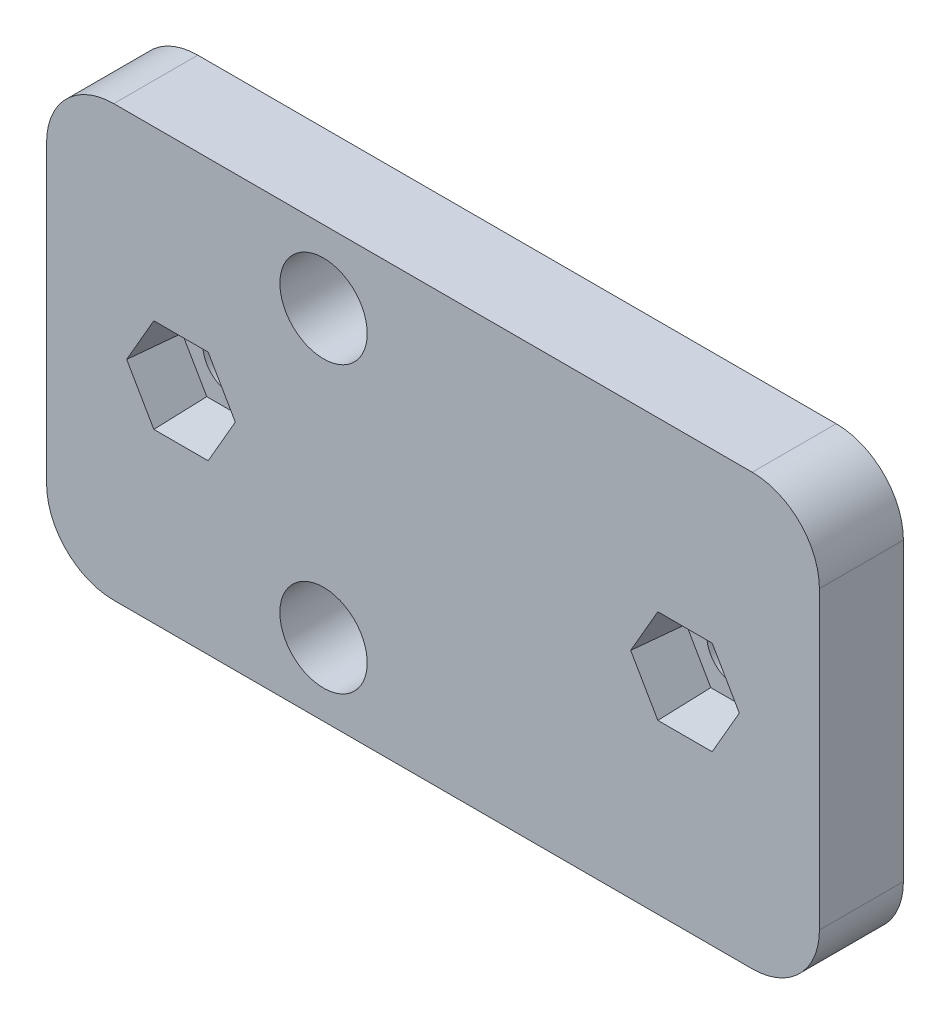
ISO-10303-21;
HEADER;
FILE_DESCRIPTION(('STEP AP214'),'2;1');
FILE_NAME('part.step','',(''),(''),'','','');
FILE_SCHEMA(('AUTOMOTIVE_DESIGN { 1 0 10303 214 1 1 1 1 }'));
ENDSEC;
DATA;
#1=APPLICATION_CONTEXT('core data for automotive mechanical design processes');
#2=APPLICATION_PROTOCOL_DEFINITION('international standard','automotive_design',2000,#1);
#3=PRODUCT_CONTEXT('',#1,'mechanical');
#4=PRODUCT('Part','Part','',(#3));
#5=PRODUCT_RELATED_PRODUCT_CATEGORY('part','',(#4));
#6=PRODUCT_DEFINITION_FORMATION('','',#4);
#7=PRODUCT_DEFINITION_CONTEXT('part definition',#1,'design');
#8=PRODUCT_DEFINITION('design','',#6,#7);
#9=PRODUCT_DEFINITION_SHAPE('','',#8);
#10=(LENGTH_UNIT() NAMED_UNIT(*) SI_UNIT(.MILLI.,.METRE.));
#11=(NAMED_UNIT(*) PLANE_ANGLE_UNIT() SI_UNIT($,.RADIAN.));
#12=(NAMED_UNIT(*) SI_UNIT($,.STERADIAN.) SOLID_ANGLE_UNIT());
#13=UNCERTAINTY_MEASURE_WITH_UNIT(LENGTH_MEASURE(1.E-05),#10,'distance_accuracy_value','');
#14=(GEOMETRIC_REPRESENTATION_CONTEXT(3) GLOBAL_UNCERTAINTY_ASSIGNED_CONTEXT((#13)) GLOBAL_UNIT_ASSIGNED_CONTEXT((#10,
#11,#12)) REPRESENTATION_CONTEXT('',''));
#15=CARTESIAN_POINT('',(0.,0.,0.));
#16=DIRECTION('',(0.,0.,1.));
#17=DIRECTION('',(1.,0.,0.));
#18=AXIS2_PLACEMENT_3D('',#15,#16,#17);
#19=CARTESIAN_POINT('',(30.8300474764991,0.,5.));
#20=DIRECTION('',(0.,0.,-1.));
#21=DIRECTION('',(-1.,0.,0.));
#22=AXIS2_PLACEMENT_3D('',#19,#20,#21);
#23=CYLINDRICAL_SURFACE('',#22,1.7);
#24=CARTESIAN_POINT('',(30.8300474764991,0.,0.));
#25=DIRECTION('',(0.,0.,1.));
#26=DIRECTION('',(-1.,0.,0.));
#27=AXIS2_PLACEMENT_3D('',#24,#25,#26);
#28=CIRCLE('',#27,1.7);
#29=CARTESIAN_POINT('',(29.1300474764991,0.,0.));
#30=VERTEX_POINT('',#29);
#31=EDGE_CURVE('E316',#30,#30,#28,.T.);
#32=ORIENTED_EDGE('',*,*,#31,.F.);
#33=EDGE_LOOP('',(#32));
#34=FACE_BOUND('',#33,.T.);
#35=CARTESIAN_POINT('',(30.8300474764991,0.,2.));
#36=DIRECTION('',(0.,0.,1.));
#37=DIRECTION('',(1.,0.,0.));
#38=AXIS2_PLACEMENT_3D('',#35,#36,#37);
#39=CIRCLE('',#38,1.7);
#40=CARTESIAN_POINT('',(32.5300474764991,0.,2.));
#41=VERTEX_POINT('',#40);
#42=EDGE_CURVE('E237',#41,#41,#39,.T.);
#43=ORIENTED_EDGE('',*,*,#42,.T.);
#44=EDGE_LOOP('',(#43));
#45=FACE_BOUND('',#44,.T.);
#46=ADVANCED_FACE('F39',(#34,#45),#23,.F.);
#47=CARTESIAN_POINT('',(0.83004747649909,0.,5.));
#48=DIRECTION('',(0.,0.,-1.));
#49=DIRECTION('',(-1.,0.,0.));
#50=AXIS2_PLACEMENT_3D('',#47,#48,#49);
#51=CYLINDRICAL_SURFACE('',#50,1.7);
#52=CARTESIAN_POINT('',(0.83004747649909,0.,0.));
#53=DIRECTION('',(0.,0.,1.));
#54=DIRECTION('',(1.,0.,0.));
#55=AXIS2_PLACEMENT_3D('',#52,#53,#54);
#56=CIRCLE('',#55,1.7);
#57=CARTESIAN_POINT('',(2.53004747649909,0.,0.));
#58=VERTEX_POINT('',#57);
#59=EDGE_CURVE('E330',#58,#58,#56,.T.);
#60=ORIENTED_EDGE('',*,*,#59,.F.);
#61=EDGE_LOOP('',(#60));
#62=FACE_BOUND('',#61,.T.);
#63=CARTESIAN_POINT('',(0.83004747649909,0.,2.));
#64=DIRECTION('',(0.,0.,1.));
#65=DIRECTION('',(1.,0.,0.));
#66=AXIS2_PLACEMENT_3D('',#63,#64,#65);
#67=CIRCLE('',#66,1.7);
#68=CARTESIAN_POINT('',(2.53004747649909,0.,2.));
#69=VERTEX_POINT('',#68);
#70=EDGE_CURVE('E287',#69,#69,#67,.T.);
#71=ORIENTED_EDGE('',*,*,#70,.T.);
#72=EDGE_LOOP('',(#71));
#73=FACE_BOUND('',#72,.T.);
#74=ADVANCED_FACE('F433',(#62,#73),#51,.F.);
#75=CARTESIAN_POINT('',(0.,0.,5.));
#76=DIRECTION('',(0.,0.,-1.));
#77=DIRECTION('',(-1.,0.,0.));
#78=AXIS2_PLACEMENT_3D('',#75,#76,#77);
#79=PLANE('',#78);
#80=DIRECTION('',(-0.5,0.866025403784439,0.));
#81=VECTOR('',#80,1.);
#82=CARTESIAN_POINT('',(34.063208983961,0.,5.));
#83=LINE('',#82,#81);
#84=CARTESIAN_POINT('',(34.063208983961,0.,5.));
#85=VERTEX_POINT('',#84);
#86=CARTESIAN_POINT('',(32.44662823023,2.8,5.));
#87=VERTEX_POINT('',#86);
#88=EDGE_CURVE('E206',#85,#87,#83,.T.);
#89=ORIENTED_EDGE('',*,*,#88,.F.);
#90=DIRECTION('',(0.5,0.866025403784439,0.));
#91=VECTOR('',#90,1.);
#92=CARTESIAN_POINT('',(32.44662823023,-2.79999999999999,5.));
#93=LINE('',#92,#91);
#94=CARTESIAN_POINT('',(32.44662823023,-2.79999999999999,5.));
#95=VERTEX_POINT('',#94);
#96=EDGE_CURVE('E211',#95,#85,#93,.T.);
#97=ORIENTED_EDGE('',*,*,#96,.F.);
#98=DIRECTION('',(1.,0.,0.));
#99=VECTOR('',#98,1.);
#100=CARTESIAN_POINT('',(29.2134667227681,-2.79999999999999,5.));
#101=LINE('',#100,#99);
#102=CARTESIAN_POINT('',(29.2134667227681,-2.79999999999999,5.));
#103=VERTEX_POINT('',#102);
#104=EDGE_CURVE('E229',#103,#95,#101,.T.);
#105=ORIENTED_EDGE('',*,*,#104,.F.);
#106=DIRECTION('',(0.499999999999999,-0.866025403784439,0.));
#107=VECTOR('',#106,1.);
#108=CARTESIAN_POINT('',(27.5968859690372,0.,5.));
#109=LINE('',#108,#107);
#110=CARTESIAN_POINT('',(27.5968859690372,0.,5.));
#111=VERTEX_POINT('',#110);
#112=EDGE_CURVE('E222',#111,#103,#109,.T.);
#113=ORIENTED_EDGE('',*,*,#112,.F.);
#114=DIRECTION('',(-0.5,-0.866025403784439,0.));
#115=VECTOR('',#114,1.);
#116=CARTESIAN_POINT('',(29.2134667227681,2.8,5.));
#117=LINE('',#116,#115);
#118=CARTESIAN_POINT('',(29.2134667227681,2.8,5.));
#119=VERTEX_POINT('',#118);
#120=EDGE_CURVE('E217',#119,#111,#117,.T.);
#121=ORIENTED_EDGE('',*,*,#120,.F.);
#122=DIRECTION('',(-1.,0.,0.));
#123=VECTOR('',#122,1.);
#124=CARTESIAN_POINT('',(32.44662823023,2.8,5.));
#125=LINE('',#124,#123);
#126=EDGE_CURVE('E193',#87,#119,#125,.T.);
#127=ORIENTED_EDGE('',*,*,#126,.F.);
#128=EDGE_LOOP('',(#89,#97,#105,#113,#121,#127));
#129=FACE_BOUND('',#128,.T.);
#130=DIRECTION('',(-0.5,0.866025403784439,0.));
#131=VECTOR('',#130,1.);
#132=CARTESIAN_POINT('',(4.063208983961,0.,5.));
#133=LINE('',#132,#131);
#134=CARTESIAN_POINT('',(4.063208983961,0.,5.));
#135=VERTEX_POINT('',#134);
#136=CARTESIAN_POINT('',(2.44662823023005,2.80000000000001,5.));
#137=VERTEX_POINT('',#136);
#138=EDGE_CURVE('E269',#135,#137,#133,.T.);
#139=ORIENTED_EDGE('',*,*,#138,.F.);
#140=DIRECTION('',(0.5,0.866025403784439,0.));
#141=VECTOR('',#140,1.);
#142=CARTESIAN_POINT('',(2.44662823023004,-2.80000000000001,5.));
#143=LINE('',#142,#141);
#144=CARTESIAN_POINT('',(2.44662823023004,-2.80000000000001,5.));
#145=VERTEX_POINT('',#144);
#146=EDGE_CURVE('E267',#145,#135,#143,.T.);
#147=ORIENTED_EDGE('',*,*,#146,.F.);
#148=DIRECTION('',(1.,0.,0.));
#149=VECTOR('',#148,1.);
#150=CARTESIAN_POINT('',(-0.786533277231866,-2.8,5.));
#151=LINE('',#150,#149);
#152=CARTESIAN_POINT('',(-0.786533277231866,-2.8,5.));
#153=VERTEX_POINT('',#152);
#154=EDGE_CURVE('E281',#153,#145,#151,.T.);
#155=ORIENTED_EDGE('',*,*,#154,.F.);
#156=DIRECTION('',(0.5,-0.866025403784439,0.));
#157=VECTOR('',#156,1.);
#158=CARTESIAN_POINT('',(-2.40311403096282,0.,5.));
#159=LINE('',#158,#157);
#160=CARTESIAN_POINT('',(-2.40311403096282,0.,5.));
#161=VERTEX_POINT('',#160);
#162=EDGE_CURVE('E278',#161,#153,#159,.T.);
#163=ORIENTED_EDGE('',*,*,#162,.F.);
#164=DIRECTION('',(-0.5,-0.866025403784439,0.));
#165=VECTOR('',#164,1.);
#166=CARTESIAN_POINT('',(-0.786533277231865,2.80000000000001,5.));
#167=LINE('',#166,#165);
#168=CARTESIAN_POINT('',(-0.786533277231865,2.80000000000001,5.));
#169=VERTEX_POINT('',#168);
#170=EDGE_CURVE('E275',#169,#161,#167,.T.);
#171=ORIENTED_EDGE('',*,*,#170,.F.);
#172=DIRECTION('',(-1.,0.,0.));
#173=VECTOR('',#172,1.);
#174=CARTESIAN_POINT('',(2.44662823023005,2.80000000000001,5.));
#175=LINE('',#174,#173);
#176=EDGE_CURVE('E272',#137,#169,#175,.T.);
#177=ORIENTED_EDGE('',*,*,#176,.F.);
#178=EDGE_LOOP('',(#139,#147,#155,#163,#171,#177));
#179=FACE_BOUND('',#178,.T.);
#180=CARTESIAN_POINT('',(9.31532885073764,-8.48528137423859,5.));
#181=DIRECTION('',(0.,0.,1.));
#182=DIRECTION('',(-1.,0.,0.));
#183=AXIS2_PLACEMENT_3D('',#180,#181,#182);
#184=CIRCLE('',#183,2.6);
#185=CARTESIAN_POINT('',(6.71532885073764,-8.48528137423859,5.));
#186=VERTEX_POINT('',#185);
#187=EDGE_CURVE('E321',#186,#186,#184,.T.);
#188=ORIENTED_EDGE('',*,*,#187,.F.);
#189=EDGE_LOOP('',(#188));
#190=FACE_BOUND('',#189,.T.);
#191=DIRECTION('',(0.,1.,0.));
#192=VECTOR('',#191,1.);
#193=CARTESIAN_POINT('',(38.8300474764991,-12.8,5.));
#194=LINE('',#193,#192);
#195=CARTESIAN_POINT('',(38.8300474764991,-8.79999999999999,5.));
#196=VERTEX_POINT('',#195);
#197=CARTESIAN_POINT('',(38.8300474764991,8.80000000000001,5.));
#198=VERTEX_POINT('',#197);
#199=EDGE_CURVE('E337',#196,#198,#194,.T.);
#200=ORIENTED_EDGE('',*,*,#199,.T.);
#201=CARTESIAN_POINT('',(34.8300474764991,8.80000000000001,5.));
#202=DIRECTION('',(0.,0.,-1.));
#203=DIRECTION('',(-1.,0.,0.));
#204=AXIS2_PLACEMENT_3D('',#201,#202,#203);
#205=CIRCLE('',#204,4.);
#206=CARTESIAN_POINT('',(34.8300474764991,12.8,5.));
#207=VERTEX_POINT('',#206);
#208=EDGE_CURVE('E387',#198,#207,#205,.F.);
#209=ORIENTED_EDGE('',*,*,#208,.T.);
#210=DIRECTION('',(-1.,0.,0.));
#211=VECTOR('',#210,1.);
#212=CARTESIAN_POINT('',(-7.16995252350091,12.8,5.));
#213=LINE('',#212,#211);
#214=CARTESIAN_POINT('',(-3.16995252350091,12.8,5.));
#215=VERTEX_POINT('',#214);
#216=EDGE_CURVE('E340',#207,#215,#213,.T.);
#217=ORIENTED_EDGE('',*,*,#216,.T.);
#218=CARTESIAN_POINT('',(-3.16995252350091,8.80000000000001,5.));
#219=DIRECTION('',(0.,0.,-1.));
#220=DIRECTION('',(-1.,0.,0.));
#221=AXIS2_PLACEMENT_3D('',#218,#219,#220);
#222=CIRCLE('',#221,4.);
#223=CARTESIAN_POINT('',(-7.16995252350091,8.80000000000001,5.));
#224=VERTEX_POINT('',#223);
#225=EDGE_CURVE('E382',#215,#224,#222,.F.);
#226=ORIENTED_EDGE('',*,*,#225,.T.);
#227=DIRECTION('',(0.,-1.,0.));
#228=VECTOR('',#227,1.);
#229=CARTESIAN_POINT('',(-7.16995252350091,-12.8,5.));
#230=LINE('',#229,#228);
#231=CARTESIAN_POINT('',(-7.16995252350091,-8.79999999999999,5.));
#232=VERTEX_POINT('',#231);
#233=EDGE_CURVE('E345',#224,#232,#230,.T.);
#234=ORIENTED_EDGE('',*,*,#233,.T.);
#235=CARTESIAN_POINT('',(-3.16995252350091,-8.79999999999999,5.));
#236=DIRECTION('',(0.,0.,-1.));
#237=DIRECTION('',(-1.,0.,0.));
#238=AXIS2_PLACEMENT_3D('',#235,#236,#237);
#239=CIRCLE('',#238,4.);
#240=CARTESIAN_POINT('',(-3.16995252350091,-12.8,5.));
#241=VERTEX_POINT('',#240);
#242=EDGE_CURVE('E61',#232,#241,#239,.F.);
#243=ORIENTED_EDGE('',*,*,#242,.T.);
#244=DIRECTION('',(1.,0.,0.));
#245=VECTOR('',#244,1.);
#246=CARTESIAN_POINT('',(-7.16995252350091,-12.8,5.));
#247=LINE('',#246,#245);
#248=CARTESIAN_POINT('',(34.8300474764991,-12.8,5.));
#249=VERTEX_POINT('',#248);
#250=EDGE_CURVE('E347',#241,#249,#247,.T.);
#251=ORIENTED_EDGE('',*,*,#250,.T.);
#252=CARTESIAN_POINT('',(34.8300474764991,-8.79999999999999,5.));
#253=DIRECTION('',(0.,0.,-1.));
#254=DIRECTION('',(-1.,0.,0.));
#255=AXIS2_PLACEMENT_3D('',#252,#253,#254);
#256=CIRCLE('',#255,4.);
#257=EDGE_CURVE('E385',#249,#196,#256,.F.);
#258=ORIENTED_EDGE('',*,*,#257,.T.);
#259=EDGE_LOOP('',(#200,#209,#217,#226,#234,#243,#251,#258));
#260=FACE_BOUND('',#259,.T.);
#261=CARTESIAN_POINT('',(9.31532885073764,8.48528137423859,5.));
#262=DIRECTION('',(0.,0.,1.));
#263=DIRECTION('',(1.,0.,0.));
#264=AXIS2_PLACEMENT_3D('',#261,#262,#263);
#265=CIRCLE('',#264,2.6);
#266=CARTESIAN_POINT('',(11.9153288507376,8.48528137423859,5.));
#267=VERTEX_POINT('',#266);
#268=EDGE_CURVE('E327',#267,#267,#265,.T.);
#269=ORIENTED_EDGE('',*,*,#268,.F.);
#270=EDGE_LOOP('',(#269));
#271=FACE_BOUND('',#270,.T.);
#272=ADVANCED_FACE('F213',(#129,#179,#190,#260,#271),#79,.F.);
#273=CARTESIAN_POINT('',(0.,0.,0.));
#274=DIRECTION('',(0.,0.,-1.));
#275=DIRECTION('',(-1.,0.,0.));
#276=AXIS2_PLACEMENT_3D('',#273,#274,#275);
#277=PLANE('',#276);
#278=CARTESIAN_POINT('',(9.31532885073764,-8.48528137423859,0.));
#279=DIRECTION('',(0.,0.,1.));
#280=DIRECTION('',(-1.,0.,0.));
#281=AXIS2_PLACEMENT_3D('',#278,#279,#280);
#282=CIRCLE('',#281,2.6);
#283=CARTESIAN_POINT('',(6.71532885073764,-8.48528137423859,0.));
#284=VERTEX_POINT('',#283);
#285=EDGE_CURVE('E320',#284,#284,#282,.T.);
#286=ORIENTED_EDGE('',*,*,#285,.T.);
#287=EDGE_LOOP('',(#286));
#288=FACE_BOUND('',#287,.T.);
#289=ORIENTED_EDGE('',*,*,#59,.T.);
#290=EDGE_LOOP('',(#289));
#291=FACE_BOUND('',#290,.T.);
#292=DIRECTION('',(-1.,0.,0.));
#293=VECTOR('',#292,1.);
#294=CARTESIAN_POINT('',(-7.16995252350091,12.8,0.));
#295=LINE('',#294,#293);
#296=CARTESIAN_POINT('',(34.8300474764991,12.8,0.));
#297=VERTEX_POINT('',#296);
#298=CARTESIAN_POINT('',(-3.16995252350091,12.8,0.));
#299=VERTEX_POINT('',#298);
#300=EDGE_CURVE('E352',#297,#299,#295,.T.);
#301=ORIENTED_EDGE('',*,*,#300,.F.);
#302=CARTESIAN_POINT('',(34.8300474764991,8.80000000000001,0.));
#303=DIRECTION('',(0.,0.,-1.));
#304=DIRECTION('',(-1.,0.,0.));
#305=AXIS2_PLACEMENT_3D('',#302,#303,#304);
#306=CIRCLE('',#305,4.);
#307=CARTESIAN_POINT('',(38.8300474764991,8.80000000000001,0.));
#308=VERTEX_POINT('',#307);
#309=EDGE_CURVE('E375',#297,#308,#306,.T.);
#310=ORIENTED_EDGE('',*,*,#309,.T.);
#311=DIRECTION('',(0.,1.,0.));
#312=VECTOR('',#311,1.);
#313=CARTESIAN_POINT('',(38.8300474764991,-12.8,0.));
#314=LINE('',#313,#312);
#315=CARTESIAN_POINT('',(38.8300474764991,-8.79999999999999,0.));
#316=VERTEX_POINT('',#315);
#317=EDGE_CURVE('E336',#316,#308,#314,.T.);
#318=ORIENTED_EDGE('',*,*,#317,.F.);
#319=CARTESIAN_POINT('',(34.8300474764991,-8.79999999999999,0.));
#320=DIRECTION('',(0.,0.,-1.));
#321=DIRECTION('',(-1.,0.,0.));
#322=AXIS2_PLACEMENT_3D('',#319,#320,#321);
#323=CIRCLE('',#322,4.);
#324=CARTESIAN_POINT('',(34.8300474764991,-12.8,0.));
#325=VERTEX_POINT('',#324);
#326=EDGE_CURVE('E373',#316,#325,#323,.T.);
#327=ORIENTED_EDGE('',*,*,#326,.T.);
#328=DIRECTION('',(1.,0.,0.));
#329=VECTOR('',#328,1.);
#330=CARTESIAN_POINT('',(-7.16995252350091,-12.8,0.));
#331=LINE('',#330,#329);
#332=CARTESIAN_POINT('',(-3.16995252350091,-12.8,0.));
#333=VERTEX_POINT('',#332);
#334=EDGE_CURVE('E341',#333,#325,#331,.T.);
#335=ORIENTED_EDGE('',*,*,#334,.F.);
#336=CARTESIAN_POINT('',(-3.16995252350091,-8.79999999999999,0.));
#337=DIRECTION('',(0.,0.,-1.));
#338=DIRECTION('',(-1.,0.,0.));
#339=AXIS2_PLACEMENT_3D('',#336,#337,#338);
#340=CIRCLE('',#339,4.);
#341=CARTESIAN_POINT('',(-7.16995252350091,-8.79999999999999,0.));
#342=VERTEX_POINT('',#341);
#343=EDGE_CURVE('E371',#333,#342,#340,.T.);
#344=ORIENTED_EDGE('',*,*,#343,.T.);
#345=DIRECTION('',(0.,-1.,0.));
#346=VECTOR('',#345,1.);
#347=CARTESIAN_POINT('',(-7.16995252350091,-12.8,0.));
#348=LINE('',#347,#346);
#349=CARTESIAN_POINT('',(-7.16995252350091,8.80000000000001,0.));
#350=VERTEX_POINT('',#349);
#351=EDGE_CURVE('E356',#350,#342,#348,.T.);
#352=ORIENTED_EDGE('',*,*,#351,.F.);
#353=CARTESIAN_POINT('',(-3.16995252350091,8.80000000000001,0.));
#354=DIRECTION('',(0.,0.,-1.));
#355=DIRECTION('',(-1.,0.,0.));
#356=AXIS2_PLACEMENT_3D('',#353,#354,#355);
#357=CIRCLE('',#356,4.);
#358=EDGE_CURVE('E369',#350,#299,#357,.T.);
#359=ORIENTED_EDGE('',*,*,#358,.T.);
#360=EDGE_LOOP('',(#301,#310,#318,#327,#335,#344,#352,#359));
#361=FACE_BOUND('',#360,.T.);
#362=CARTESIAN_POINT('',(9.31532885073764,8.48528137423859,0.));
#363=DIRECTION('',(0.,0.,1.));
#364=DIRECTION('',(1.,0.,0.));
#365=AXIS2_PLACEMENT_3D('',#362,#363,#364);
#366=CIRCLE('',#365,2.6);
#367=CARTESIAN_POINT('',(11.9153288507376,8.48528137423859,0.));
#368=VERTEX_POINT('',#367);
#369=EDGE_CURVE('E324',#368,#368,#366,.T.);
#370=ORIENTED_EDGE('',*,*,#369,.T.);
#371=EDGE_LOOP('',(#370));
#372=FACE_BOUND('',#371,.T.);
#373=ORIENTED_EDGE('',*,*,#31,.T.);
#374=EDGE_LOOP('',(#373));
#375=FACE_BOUND('',#374,.T.);
#376=ADVANCED_FACE('F403',(#288,#291,#361,#372,#375),#277,.T.);
#377=CARTESIAN_POINT('',(38.8300474764991,-12.8,5.));
#378=DIRECTION('',(-1.,0.,0.));
#379=DIRECTION('',(0.,0.,1.));
#380=AXIS2_PLACEMENT_3D('',#377,#378,#379);
#381=PLANE('',#380);
#382=ORIENTED_EDGE('',*,*,#317,.T.);
#383=DIRECTION('',(0.,0.,-1.));
#384=VECTOR('',#383,1.);
#385=CARTESIAN_POINT('',(38.8300474764991,8.80000000000001,5.));
#386=LINE('',#385,#384);
#387=EDGE_CURVE('E380',#308,#198,#386,.F.);
#388=ORIENTED_EDGE('',*,*,#387,.T.);
#389=ORIENTED_EDGE('',*,*,#199,.F.);
#390=DIRECTION('',(0.,0.,-1.));
#391=VECTOR('',#390,1.);
#392=CARTESIAN_POINT('',(38.8300474764991,-8.79999999999999,5.));
#393=LINE('',#392,#391);
#394=EDGE_CURVE('E377',#196,#316,#393,.T.);
#395=ORIENTED_EDGE('',*,*,#394,.T.);
#396=EDGE_LOOP('',(#382,#388,#389,#395));
#397=FACE_BOUND('',#396,.T.);
#398=ADVANCED_FACE('F418',(#397),#381,.F.);
#399=CARTESIAN_POINT('',(-7.16995252350091,12.8,5.));
#400=DIRECTION('',(0.,-1.,0.));
#401=DIRECTION('',(0.,0.,-1.));
#402=AXIS2_PLACEMENT_3D('',#399,#400,#401);
#403=PLANE('',#402);
#404=ORIENTED_EDGE('',*,*,#216,.F.);
#405=DIRECTION('',(0.,0.,-1.));
#406=VECTOR('',#405,1.);
#407=CARTESIAN_POINT('',(34.8300474764991,12.8,5.));
#408=LINE('',#407,#406);
#409=EDGE_CURVE('E366',#207,#297,#408,.T.);
#410=ORIENTED_EDGE('',*,*,#409,.T.);
#411=ORIENTED_EDGE('',*,*,#300,.T.);
#412=DIRECTION('',(0.,0.,-1.));
#413=VECTOR('',#412,1.);
#414=CARTESIAN_POINT('',(-3.16995252350091,12.8,5.));
#415=LINE('',#414,#413);
#416=EDGE_CURVE('E349',#299,#215,#415,.F.);
#417=ORIENTED_EDGE('',*,*,#416,.T.);
#418=EDGE_LOOP('',(#404,#410,#411,#417));
#419=FACE_BOUND('',#418,.T.);
#420=ADVANCED_FACE('F426',(#419),#403,.F.);
#421=CARTESIAN_POINT('',(-7.16995252350091,-12.8,5.));
#422=DIRECTION('',(1.,0.,0.));
#423=DIRECTION('',(0.,0.,-1.));
#424=AXIS2_PLACEMENT_3D('',#421,#422,#423);
#425=PLANE('',#424);
#426=ORIENTED_EDGE('',*,*,#351,.T.);
#427=DIRECTION('',(0.,0.,-1.));
#428=VECTOR('',#427,1.);
#429=CARTESIAN_POINT('',(-7.16995252350091,-8.79999999999999,5.));
#430=LINE('',#429,#428);
#431=EDGE_CURVE('E11',#342,#232,#430,.F.);
#432=ORIENTED_EDGE('',*,*,#431,.T.);
#433=ORIENTED_EDGE('',*,*,#233,.F.);
#434=DIRECTION('',(0.,0.,-1.));
#435=VECTOR('',#434,1.);
#436=CARTESIAN_POINT('',(-7.16995252350091,8.80000000000001,5.));
#437=LINE('',#436,#435);
#438=EDGE_CURVE('E47',#224,#350,#437,.T.);
#439=ORIENTED_EDGE('',*,*,#438,.T.);
#440=EDGE_LOOP('',(#426,#432,#433,#439));
#441=FACE_BOUND('',#440,.T.);
#442=ADVANCED_FACE('F397',(#441),#425,.F.);
#443=CARTESIAN_POINT('',(-7.16995252350091,-12.8,5.));
#444=DIRECTION('',(0.,1.,0.));
#445=DIRECTION('',(0.,0.,1.));
#446=AXIS2_PLACEMENT_3D('',#443,#444,#445);
#447=PLANE('',#446);
#448=ORIENTED_EDGE('',*,*,#334,.T.);
#449=DIRECTION('',(0.,0.,-1.));
#450=VECTOR('',#449,1.);
#451=CARTESIAN_POINT('',(34.8300474764991,-12.8,5.));
#452=LINE('',#451,#450);
#453=EDGE_CURVE('E54',#325,#249,#452,.F.);
#454=ORIENTED_EDGE('',*,*,#453,.T.);
#455=ORIENTED_EDGE('',*,*,#250,.F.);
#456=DIRECTION('',(0.,0.,-1.));
#457=VECTOR('',#456,1.);
#458=CARTESIAN_POINT('',(-3.16995252350091,-12.8,5.));
#459=LINE('',#458,#457);
#460=EDGE_CURVE('E389',#241,#333,#459,.T.);
#461=ORIENTED_EDGE('',*,*,#460,.T.);
#462=EDGE_LOOP('',(#448,#454,#455,#461));
#463=FACE_BOUND('',#462,.T.);
#464=ADVANCED_FACE('F409',(#463),#447,.F.);
#465=CARTESIAN_POINT('',(9.31532885073764,8.48528137423859,5.));
#466=DIRECTION('',(0.,0.,-1.));
#467=DIRECTION('',(-1.,0.,0.));
#468=AXIS2_PLACEMENT_3D('',#465,#466,#467);
#469=CYLINDRICAL_SURFACE('',#468,2.6);
#470=ORIENTED_EDGE('',*,*,#268,.T.);
#471=EDGE_LOOP('',(#470));
#472=FACE_BOUND('',#471,.T.);
#473=ORIENTED_EDGE('',*,*,#369,.F.);
#474=EDGE_LOOP('',(#473));
#475=FACE_BOUND('',#474,.T.);
#476=ADVANCED_FACE('F451',(#472,#475),#469,.F.);
#477=CARTESIAN_POINT('',(9.31532885073764,-8.48528137423859,5.));
#478=DIRECTION('',(0.,0.,-1.));
#479=DIRECTION('',(-1.,0.,0.));
#480=AXIS2_PLACEMENT_3D('',#477,#478,#479);
#481=CYLINDRICAL_SURFACE('',#480,2.6);
#482=ORIENTED_EDGE('',*,*,#187,.T.);
#483=EDGE_LOOP('',(#482));
#484=FACE_BOUND('',#483,.T.);
#485=ORIENTED_EDGE('',*,*,#285,.F.);
#486=EDGE_LOOP('',(#485));
#487=FACE_BOUND('',#486,.T.);
#488=ADVANCED_FACE('F447',(#484,#487),#481,.F.);
#489=CARTESIAN_POINT('',(2.44662823023004,-2.80000000000001,5.));
#490=DIRECTION('',(0.862729915662821,-0.498097349045873,-0.0871557427476584));
#491=DIRECTION('',(0.5,0.866025403784438,0.));
#492=AXIS2_PLACEMENT_3D('',#489,#490,#491);
#493=PLANE('',#492);
#494=ORIENTED_EDGE('',*,*,#146,.T.);
#495=DIRECTION('',(0.100511613750393,0.,0.994935885120891));
#496=VECTOR('',#495,1.);
#497=CARTESIAN_POINT('',(4.04687734029745,0.,4.83833770310138));
#498=LINE('',#497,#496);
#499=CARTESIAN_POINT('',(3.7601393633346,0.,2.));
#500=VERTEX_POINT('',#499);
#501=EDGE_CURVE('E289',#500,#135,#498,.T.);
#502=ORIENTED_EDGE('',*,*,#501,.F.);
#503=DIRECTION('',(0.5,0.866025403784438,0.));
#504=VECTOR('',#503,1.);
#505=CARTESIAN_POINT('',(2.82010452250095,-1.62818810520881,2.));
#506=LINE('',#505,#504);
#507=CARTESIAN_POINT('',(2.29509341991684,-2.53753400942223,2.));
#508=VERTEX_POINT('',#507);
#509=EDGE_CURVE('E284',#508,#500,#506,.T.);
#510=ORIENTED_EDGE('',*,*,#509,.F.);
#511=DIRECTION('',(0.0502558068751962,-0.0870456108832093,0.994935885120892));
#512=VECTOR('',#511,1.);
#513=CARTESIAN_POINT('',(2.43846240839827,-2.78585638170182,4.83833770310138));
#514=LINE('',#513,#512);
#515=EDGE_CURVE('E285',#508,#145,#514,.T.);
#516=ORIENTED_EDGE('',*,*,#515,.T.);
#517=EDGE_LOOP('',(#494,#502,#510,#516));
#518=FACE_BOUND('',#517,.T.);
#519=ADVANCED_FACE('F450',(#518),#493,.F.);
#520=CARTESIAN_POINT('',(-0.786533277231866,-2.8,5.));
#521=DIRECTION('',(0.,-0.996194698091745,-0.0871557427476584));
#522=DIRECTION('',(0.,0.0871557427476584,-0.996194698091746));
#523=AXIS2_PLACEMENT_3D('',#520,#521,#522);
#524=PLANE('',#523);
#525=ORIENTED_EDGE('',*,*,#154,.T.);
#526=ORIENTED_EDGE('',*,*,#515,.F.);
#527=DIRECTION('',(1.,0.,0.));
#528=VECTOR('',#527,1.);
#529=CARTESIAN_POINT('',(0.,-2.53753400942223,2.));
#530=LINE('',#529,#528);
#531=CARTESIAN_POINT('',(-0.634998466918667,-2.53753400942223,2.));
#532=VERTEX_POINT('',#531);
#533=EDGE_CURVE('E293',#532,#508,#530,.T.);
#534=ORIENTED_EDGE('',*,*,#533,.F.);
#535=DIRECTION('',(-0.0502558068751963,-0.0870456108832092,0.994935885120891));
#536=VECTOR('',#535,1.);
#537=CARTESIAN_POINT('',(-0.77836745540009,-2.78585638170181,4.83833770310138));
#538=LINE('',#537,#536);
#539=EDGE_CURVE('E288',#532,#153,#538,.T.);
#540=ORIENTED_EDGE('',*,*,#539,.T.);
#541=EDGE_LOOP('',(#525,#526,#534,#540));
#542=FACE_BOUND('',#541,.T.);
#543=ADVANCED_FACE('F445',(#542),#524,.F.);
#544=CARTESIAN_POINT('',(-2.40311403096282,0.,5.));
#545=DIRECTION('',(-0.862729915662821,-0.498097349045873,-0.0871557427476584));
#546=DIRECTION('',(0.5,-0.866025403784439,0.));
#547=AXIS2_PLACEMENT_3D('',#544,#545,#546);
#548=PLANE('',#547);
#549=ORIENTED_EDGE('',*,*,#162,.T.);
#550=ORIENTED_EDGE('',*,*,#539,.F.);
#551=DIRECTION('',(0.5,-0.866025403784439,0.));
#552=VECTOR('',#551,1.);
#553=CARTESIAN_POINT('',(-1.57503330775232,-0.909345904213427,2.));
#554=LINE('',#553,#552);
#555=CARTESIAN_POINT('',(-2.10004441033642,0.,2.));
#556=VERTEX_POINT('',#555);
#557=EDGE_CURVE('E305',#556,#532,#554,.T.);
#558=ORIENTED_EDGE('',*,*,#557,.F.);
#559=DIRECTION('',(-0.100511613750393,0.,0.994935885120892));
#560=VECTOR('',#559,1.);
#561=CARTESIAN_POINT('',(-2.38678238729927,0.,4.83833770310138));
#562=LINE('',#561,#560);
#563=EDGE_CURVE('E297',#556,#161,#562,.T.);
#564=ORIENTED_EDGE('',*,*,#563,.T.);
#565=EDGE_LOOP('',(#549,#550,#558,#564));
#566=FACE_BOUND('',#565,.T.);
#567=ADVANCED_FACE('F590',(#566),#548,.F.);
#568=CARTESIAN_POINT('',(-0.786533277231865,2.80000000000001,5.));
#569=DIRECTION('',(-0.862729915662821,0.498097349045873,-0.0871557427476584));
#570=DIRECTION('',(-0.5,-0.866025403784439,0.));
#571=AXIS2_PLACEMENT_3D('',#568,#569,#570);
#572=PLANE('',#571);
#573=ORIENTED_EDGE('',*,*,#170,.T.);
#574=ORIENTED_EDGE('',*,*,#563,.F.);
#575=DIRECTION('',(-0.5,-0.866025403784439,0.));
#576=VECTOR('',#575,1.);
#577=CARTESIAN_POINT('',(-1.57503330775232,0.909345904213428,2.));
#578=LINE('',#577,#576);
#579=CARTESIAN_POINT('',(-0.634998466918666,2.53753400942223,2.));
#580=VERTEX_POINT('',#579);
#581=EDGE_CURVE('E308',#580,#556,#578,.T.);
#582=ORIENTED_EDGE('',*,*,#581,.F.);
#583=DIRECTION('',(-0.0502558068751962,0.0870456108832093,0.994935885120891));
#584=VECTOR('',#583,1.);
#585=CARTESIAN_POINT('',(-0.778367455400089,2.78585638170182,4.83833770310138));
#586=LINE('',#585,#584);
#587=EDGE_CURVE('E295',#580,#169,#586,.T.);
#588=ORIENTED_EDGE('',*,*,#587,.T.);
#589=EDGE_LOOP('',(#573,#574,#582,#588));
#590=FACE_BOUND('',#589,.T.);
#591=ADVANCED_FACE('F581',(#590),#572,.F.);
#592=CARTESIAN_POINT('',(2.44662823023005,2.80000000000001,5.));
#593=DIRECTION('',(0.,0.996194698091746,-0.0871557427476584));
#594=DIRECTION('',(0.,0.0871557427476584,0.996194698091746));
#595=AXIS2_PLACEMENT_3D('',#592,#593,#594);
#596=PLANE('',#595);
#597=ORIENTED_EDGE('',*,*,#176,.T.);
#598=ORIENTED_EDGE('',*,*,#587,.F.);
#599=DIRECTION('',(-1.,0.,0.));
#600=VECTOR('',#599,1.);
#601=CARTESIAN_POINT('',(0.,2.53753400942223,2.));
#602=LINE('',#601,#600);
#603=CARTESIAN_POINT('',(2.29509341991685,2.53753400942223,2.));
#604=VERTEX_POINT('',#603);
#605=EDGE_CURVE('E311',#604,#580,#602,.T.);
#606=ORIENTED_EDGE('',*,*,#605,.F.);
#607=DIRECTION('',(0.0502558068751963,0.0870456108832093,0.994935885120892));
#608=VECTOR('',#607,1.);
#609=CARTESIAN_POINT('',(2.43846240839827,2.78585638170181,4.83833770310138));
#610=LINE('',#609,#608);
#611=EDGE_CURVE('E292',#604,#137,#610,.T.);
#612=ORIENTED_EDGE('',*,*,#611,.T.);
#613=EDGE_LOOP('',(#597,#598,#606,#612));
#614=FACE_BOUND('',#613,.T.);
#615=ADVANCED_FACE('F572',(#614),#596,.F.);
#616=CARTESIAN_POINT('',(4.063208983961,0.,5.));
#617=DIRECTION('',(0.862729915662821,0.498097349045872,-0.0871557427476584));
#618=DIRECTION('',(-0.5,0.866025403784439,0.));
#619=AXIS2_PLACEMENT_3D('',#616,#617,#618);
#620=PLANE('',#619);
#621=ORIENTED_EDGE('',*,*,#138,.T.);
#622=ORIENTED_EDGE('',*,*,#611,.F.);
#623=DIRECTION('',(-0.5,0.866025403784439,0.));
#624=VECTOR('',#623,1.);
#625=CARTESIAN_POINT('',(2.82010452250095,1.62818810520881,2.));
#626=LINE('',#625,#624);
#627=EDGE_CURVE('E302',#500,#604,#626,.T.);
#628=ORIENTED_EDGE('',*,*,#627,.F.);
#629=ORIENTED_EDGE('',*,*,#501,.T.);
#630=EDGE_LOOP('',(#621,#622,#628,#629));
#631=FACE_BOUND('',#630,.T.);
#632=ADVANCED_FACE('F563',(#631),#620,.F.);
#633=CARTESIAN_POINT('',(0.,0.,2.));
#634=DIRECTION('',(0.,0.,1.));
#635=DIRECTION('',(1.,0.,0.));
#636=AXIS2_PLACEMENT_3D('',#633,#634,#635);
#637=PLANE('',#636);
#638=ORIENTED_EDGE('',*,*,#70,.F.);
#639=EDGE_LOOP('',(#638));
#640=FACE_BOUND('',#639,.T.);
#641=ORIENTED_EDGE('',*,*,#509,.T.);
#642=ORIENTED_EDGE('',*,*,#627,.T.);
#643=ORIENTED_EDGE('',*,*,#605,.T.);
#644=ORIENTED_EDGE('',*,*,#581,.T.);
#645=ORIENTED_EDGE('',*,*,#557,.T.);
#646=ORIENTED_EDGE('',*,*,#533,.T.);
#647=EDGE_LOOP('',(#641,#642,#643,#644,#645,#646));
#648=FACE_BOUND('',#647,.T.);
#649=ADVANCED_FACE('F554',(#640,#648),#637,.T.);
#650=CARTESIAN_POINT('',(32.44662823023,-2.79999999999999,5.));
#651=DIRECTION('',(0.862729915662821,-0.498097349045872,-0.0871557427476584));
#652=DIRECTION('',(0.5,0.866025403784439,0.));
#653=AXIS2_PLACEMENT_3D('',#650,#651,#652);
#654=PLANE('',#653);
#655=ORIENTED_EDGE('',*,*,#96,.T.);
#656=DIRECTION('',(0.100511613750393,0.,0.994935885120891));
#657=VECTOR('',#656,1.);
#658=CARTESIAN_POINT('',(34.0468773402974,0.,4.83833770310138));
#659=LINE('',#658,#657);
#660=CARTESIAN_POINT('',(33.7601393633346,0.,2.));
#661=VERTEX_POINT('',#660);
#662=EDGE_CURVE('E202',#661,#85,#659,.T.);
#663=ORIENTED_EDGE('',*,*,#662,.F.);
#664=DIRECTION('',(0.5,0.866025403784439,0.));
#665=VECTOR('',#664,1.);
#666=CARTESIAN_POINT('',(25.320104522501,-14.6185691619754,2.));
#667=LINE('',#666,#665);
#668=CARTESIAN_POINT('',(32.2950934199168,-2.53753400942222,2.));
#669=VERTEX_POINT('',#668);
#670=EDGE_CURVE('E233',#669,#661,#667,.T.);
#671=ORIENTED_EDGE('',*,*,#670,.F.);
#672=DIRECTION('',(0.0502558068751963,-0.0870456108832093,0.994935885120892));
#673=VECTOR('',#672,1.);
#674=CARTESIAN_POINT('',(32.4384624083983,-2.7858563817018,4.83833770310138));
#675=LINE('',#674,#673);
#676=EDGE_CURVE('E234',#669,#95,#675,.T.);
#677=ORIENTED_EDGE('',*,*,#676,.T.);
#678=EDGE_LOOP('',(#655,#663,#671,#677));
#679=FACE_BOUND('',#678,.T.);
#680=ADVANCED_FACE('F545',(#679),#654,.F.);
#681=CARTESIAN_POINT('',(29.2134667227681,-2.79999999999999,5.));
#682=DIRECTION('',(0.,-0.996194698091746,-0.0871557427476584));
#683=DIRECTION('',(0.,0.0871557427476584,-0.996194698091746));
#684=AXIS2_PLACEMENT_3D('',#681,#682,#683);
#685=PLANE('',#684);
#686=ORIENTED_EDGE('',*,*,#104,.T.);
#687=ORIENTED_EDGE('',*,*,#676,.F.);
#688=DIRECTION('',(1.,0.,0.));
#689=VECTOR('',#688,1.);
#690=CARTESIAN_POINT('',(0.,-2.53753400942222,2.));
#691=LINE('',#690,#689);
#692=CARTESIAN_POINT('',(29.3650015330813,-2.53753400942222,2.));
#693=VERTEX_POINT('',#692);
#694=EDGE_CURVE('E240',#693,#669,#691,.T.);
#695=ORIENTED_EDGE('',*,*,#694,.F.);
#696=DIRECTION('',(-0.0502558068751963,-0.0870456108832093,0.994935885120891));
#697=VECTOR('',#696,1.);
#698=CARTESIAN_POINT('',(29.2216325445999,-2.7858563817018,4.83833770310138));
#699=LINE('',#698,#697);
#700=EDGE_CURVE('E238',#693,#103,#699,.T.);
#701=ORIENTED_EDGE('',*,*,#700,.T.);
#702=EDGE_LOOP('',(#686,#687,#695,#701));
#703=FACE_BOUND('',#702,.T.);
#704=ADVANCED_FACE('F536',(#703),#685,.F.);
#705=CARTESIAN_POINT('',(27.5968859690372,0.,5.));
#706=DIRECTION('',(-0.862729915662821,-0.498097349045872,-0.0871557427476584));
#707=DIRECTION('',(0.499999999999999,-0.866025403784439,0.));
#708=AXIS2_PLACEMENT_3D('',#705,#706,#707);
#709=PLANE('',#708);
#710=ORIENTED_EDGE('',*,*,#112,.T.);
#711=ORIENTED_EDGE('',*,*,#700,.F.);
#712=DIRECTION('',(0.499999999999999,-0.866025403784439,0.));
#713=VECTOR('',#712,1.);
#714=CARTESIAN_POINT('',(20.9249666922477,12.0810351525531,2.));
#715=LINE('',#714,#713);
#716=CARTESIAN_POINT('',(27.8999555896636,0.,2.));
#717=VERTEX_POINT('',#716);
#718=EDGE_CURVE('E255',#717,#693,#715,.T.);
#719=ORIENTED_EDGE('',*,*,#718,.F.);
#720=DIRECTION('',(-0.100511613750393,0.,0.994935885120892));
#721=VECTOR('',#720,1.);
#722=CARTESIAN_POINT('',(27.6132176127007,0.,4.83833770310138));
#723=LINE('',#722,#721);
#724=EDGE_CURVE('E244',#717,#111,#723,.T.);
#725=ORIENTED_EDGE('',*,*,#724,.T.);
#726=EDGE_LOOP('',(#710,#711,#719,#725));
#727=FACE_BOUND('',#726,.T.);
#728=ADVANCED_FACE('F526',(#727),#709,.F.);
#729=CARTESIAN_POINT('',(29.2134667227681,2.8,5.));
#730=DIRECTION('',(-0.862729915662821,0.498097349045873,-0.0871557427476584));
#731=DIRECTION('',(-0.5,-0.866025403784439,0.));
#732=AXIS2_PLACEMENT_3D('',#729,#730,#731);
#733=PLANE('',#732);
#734=ORIENTED_EDGE('',*,*,#120,.T.);
#735=ORIENTED_EDGE('',*,*,#724,.F.);
#736=DIRECTION('',(-0.5,-0.866025403784439,0.));
#737=VECTOR('',#736,1.);
#738=CARTESIAN_POINT('',(20.9249666922477,-12.0810351525532,2.));
#739=LINE('',#738,#737);
#740=CARTESIAN_POINT('',(29.3650015330813,2.53753400942223,2.));
#741=VERTEX_POINT('',#740);
#742=EDGE_CURVE('E259',#741,#717,#739,.T.);
#743=ORIENTED_EDGE('',*,*,#742,.F.);
#744=DIRECTION('',(-0.0502558068751963,0.0870456108832093,0.994935885120892));
#745=VECTOR('',#744,1.);
#746=CARTESIAN_POINT('',(29.2216325445999,2.78585638170181,4.83833770310138));
#747=LINE('',#746,#745);
#748=EDGE_CURVE('E201',#741,#119,#747,.T.);
#749=ORIENTED_EDGE('',*,*,#748,.T.);
#750=EDGE_LOOP('',(#734,#735,#743,#749));
#751=FACE_BOUND('',#750,.T.);
#752=ADVANCED_FACE('F518',(#751),#733,.F.);
#753=CARTESIAN_POINT('',(32.44662823023,2.8,5.));
#754=DIRECTION('',(0.,0.996194698091746,-0.0871557427476584));
#755=DIRECTION('',(0.,0.0871557427476584,0.996194698091746));
#756=AXIS2_PLACEMENT_3D('',#753,#754,#755);
#757=PLANE('',#756);
#758=ORIENTED_EDGE('',*,*,#126,.T.);
#759=ORIENTED_EDGE('',*,*,#748,.F.);
#760=DIRECTION('',(-1.,0.,0.));
#761=VECTOR('',#760,1.);
#762=CARTESIAN_POINT('',(0.,2.53753400942223,2.));
#763=LINE('',#762,#761);
#764=CARTESIAN_POINT('',(32.2950934199168,2.53753400942223,2.));
#765=VERTEX_POINT('',#764);
#766=EDGE_CURVE('E196',#765,#741,#763,.T.);
#767=ORIENTED_EDGE('',*,*,#766,.F.);
#768=DIRECTION('',(0.0502558068751963,0.0870456108832093,0.994935885120891));
#769=VECTOR('',#768,1.);
#770=CARTESIAN_POINT('',(32.4384624083983,2.78585638170181,4.83833770310138));
#771=LINE('',#770,#769);
#772=EDGE_CURVE('E189',#765,#87,#771,.T.);
#773=ORIENTED_EDGE('',*,*,#772,.T.);
#774=EDGE_LOOP('',(#758,#759,#767,#773));
#775=FACE_BOUND('',#774,.T.);
#776=ADVANCED_FACE('F191',(#775),#757,.F.);
#777=CARTESIAN_POINT('',(34.063208983961,0.,5.));
#778=DIRECTION('',(0.862729915662821,0.498097349045872,-0.0871557427476584));
#779=DIRECTION('',(-0.5,0.866025403784439,0.));
#780=AXIS2_PLACEMENT_3D('',#777,#778,#779);
#781=PLANE('',#780);
#782=ORIENTED_EDGE('',*,*,#88,.T.);
#783=ORIENTED_EDGE('',*,*,#772,.F.);
#784=DIRECTION('',(-0.5,0.866025403784439,0.));
#785=VECTOR('',#784,1.);
#786=CARTESIAN_POINT('',(25.320104522501,14.6185691619754,2.));
#787=LINE('',#786,#785);
#788=EDGE_CURVE('E251',#661,#765,#787,.T.);
#789=ORIENTED_EDGE('',*,*,#788,.F.);
#790=ORIENTED_EDGE('',*,*,#662,.T.);
#791=EDGE_LOOP('',(#782,#783,#789,#790));
#792=FACE_BOUND('',#791,.T.);
#793=ADVANCED_FACE('F207',(#792),#781,.F.);
#794=CARTESIAN_POINT('',(0.,0.,2.));
#795=DIRECTION('',(0.,0.,1.));
#796=DIRECTION('',(1.,0.,0.));
#797=AXIS2_PLACEMENT_3D('',#794,#795,#796);
#798=PLANE('',#797);
#799=ORIENTED_EDGE('',*,*,#42,.F.);
#800=EDGE_LOOP('',(#799));
#801=FACE_BOUND('',#800,.T.);
#802=ORIENTED_EDGE('',*,*,#670,.T.);
#803=ORIENTED_EDGE('',*,*,#788,.T.);
#804=ORIENTED_EDGE('',*,*,#766,.T.);
#805=ORIENTED_EDGE('',*,*,#742,.T.);
#806=ORIENTED_EDGE('',*,*,#718,.T.);
#807=ORIENTED_EDGE('',*,*,#694,.T.);
#808=EDGE_LOOP('',(#802,#803,#804,#805,#806,#807));
#809=FACE_BOUND('',#808,.T.);
#810=ADVANCED_FACE('F471',(#801,#809),#798,.T.);
#811=CARTESIAN_POINT('',(34.8300474764991,8.80000000000001,5.));
#812=DIRECTION('',(0.,0.,-1.));
#813=DIRECTION('',(-1.,0.,0.));
#814=AXIS2_PLACEMENT_3D('',#811,#812,#813);
#815=CYLINDRICAL_SURFACE('',#814,4.);
#816=ORIENTED_EDGE('',*,*,#208,.F.);
#817=ORIENTED_EDGE('',*,*,#387,.F.);
#818=ORIENTED_EDGE('',*,*,#309,.F.);
#819=ORIENTED_EDGE('',*,*,#409,.F.);
#820=EDGE_LOOP('',(#816,#817,#818,#819));
#821=FACE_BOUND('',#820,.T.);
#822=ADVANCED_FACE('F423',(#821),#815,.T.);
#823=CARTESIAN_POINT('',(34.8300474764991,-8.79999999999999,5.));
#824=DIRECTION('',(0.,0.,-1.));
#825=DIRECTION('',(-1.,0.,0.));
#826=AXIS2_PLACEMENT_3D('',#823,#824,#825);
#827=CYLINDRICAL_SURFACE('',#826,4.);
#828=ORIENTED_EDGE('',*,*,#257,.F.);
#829=ORIENTED_EDGE('',*,*,#453,.F.);
#830=ORIENTED_EDGE('',*,*,#326,.F.);
#831=ORIENTED_EDGE('',*,*,#394,.F.);
#832=EDGE_LOOP('',(#828,#829,#830,#831));
#833=FACE_BOUND('',#832,.T.);
#834=ADVANCED_FACE('F415',(#833),#827,.T.);
#835=CARTESIAN_POINT('',(-3.16995252350091,-8.79999999999999,5.));
#836=DIRECTION('',(0.,0.,-1.));
#837=DIRECTION('',(-1.,0.,0.));
#838=AXIS2_PLACEMENT_3D('',#835,#836,#837);
#839=CYLINDRICAL_SURFACE('',#838,4.);
#840=ORIENTED_EDGE('',*,*,#242,.F.);
#841=ORIENTED_EDGE('',*,*,#431,.F.);
#842=ORIENTED_EDGE('',*,*,#343,.F.);
#843=ORIENTED_EDGE('',*,*,#460,.F.);
#844=EDGE_LOOP('',(#840,#841,#842,#843));
#845=FACE_BOUND('',#844,.T.);
#846=ADVANCED_FACE('F408',(#845),#839,.T.);
#847=CARTESIAN_POINT('',(-3.16995252350091,8.80000000000001,5.));
#848=DIRECTION('',(0.,0.,-1.));
#849=DIRECTION('',(-1.,0.,0.));
#850=AXIS2_PLACEMENT_3D('',#847,#848,#849);
#851=CYLINDRICAL_SURFACE('',#850,4.);
#852=ORIENTED_EDGE('',*,*,#225,.F.);
#853=ORIENTED_EDGE('',*,*,#416,.F.);
#854=ORIENTED_EDGE('',*,*,#358,.F.);
#855=ORIENTED_EDGE('',*,*,#438,.F.);
#856=EDGE_LOOP('',(#852,#853,#854,#855));
#857=FACE_BOUND('',#856,.T.);
#858=ADVANCED_FACE('F41',(#857),#851,.T.);
#859=CLOSED_SHELL('',(#46,#74,#272,#376,#398,#420,#442,#464,#476,#488,#519,#543,#567,#591,#615,
#632,#649,#680,#704,#728,#752,#776,#793,#810,#822,#834,#846,#858));
#860=MANIFOLD_SOLID_BREP('B2',#859);
#861=ADVANCED_BREP_SHAPE_REPRESENTATION('',(#18,#860),#14);
#862=SHAPE_DEFINITION_REPRESENTATION(#9,#861);
ENDSEC;
END-ISO-10303-21;
